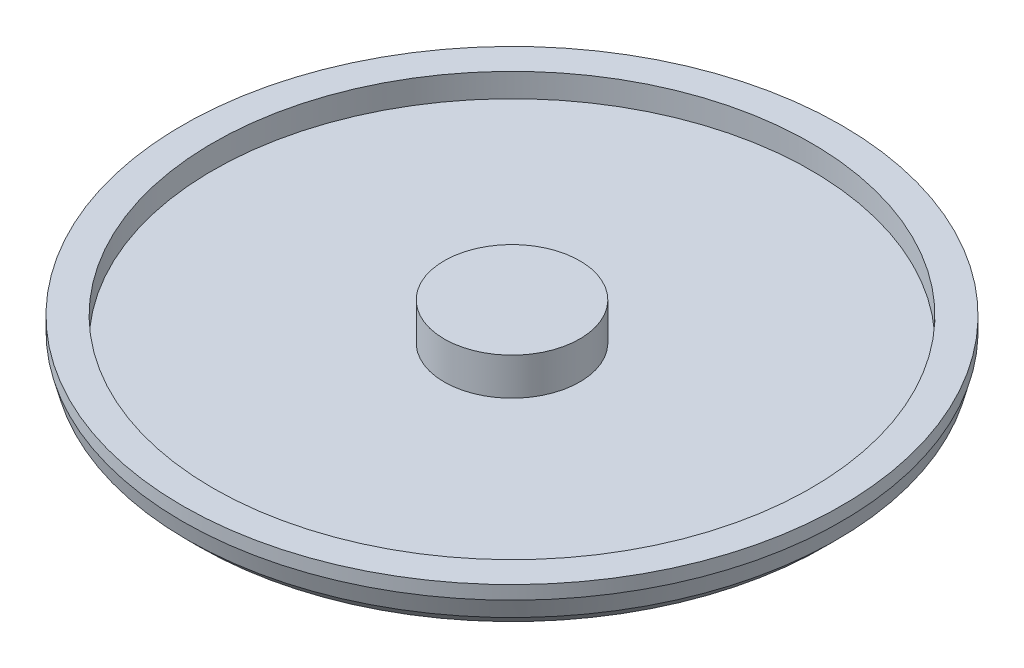
ISO-10303-21;
HEADER;
FILE_DESCRIPTION(('STEP AP214'),'2;1');
FILE_NAME('part.step','',(''),(''),'','','');
FILE_SCHEMA(('AUTOMOTIVE_DESIGN { 1 0 10303 214 1 1 1 1 }'));
ENDSEC;
DATA;
#1=APPLICATION_CONTEXT('core data for automotive mechanical design processes');
#2=APPLICATION_PROTOCOL_DEFINITION('international standard','automotive_design',2000,#1);
#3=PRODUCT_CONTEXT('',#1,'mechanical');
#4=PRODUCT('Part','Part','',(#3));
#5=PRODUCT_RELATED_PRODUCT_CATEGORY('part','',(#4));
#6=PRODUCT_DEFINITION_FORMATION('','',#4);
#7=PRODUCT_DEFINITION_CONTEXT('part definition',#1,'design');
#8=PRODUCT_DEFINITION('design','',#6,#7);
#9=PRODUCT_DEFINITION_SHAPE('','',#8);
#10=(LENGTH_UNIT() NAMED_UNIT(*) SI_UNIT(.MILLI.,.METRE.));
#11=(NAMED_UNIT(*) PLANE_ANGLE_UNIT() SI_UNIT($,.RADIAN.));
#12=(NAMED_UNIT(*) SI_UNIT($,.STERADIAN.) SOLID_ANGLE_UNIT());
#13=UNCERTAINTY_MEASURE_WITH_UNIT(LENGTH_MEASURE(1.E-05),#10,'distance_accuracy_value','');
#14=(GEOMETRIC_REPRESENTATION_CONTEXT(3) GLOBAL_UNCERTAINTY_ASSIGNED_CONTEXT((#13)) GLOBAL_UNIT_ASSIGNED_CONTEXT((#10,
#11,#12)) REPRESENTATION_CONTEXT('',''));
#15=CARTESIAN_POINT('',(0.,0.,0.));
#16=DIRECTION('',(0.,0.,1.));
#17=DIRECTION('',(1.,0.,0.));
#18=AXIS2_PLACEMENT_3D('',#15,#16,#17);
#19=CARTESIAN_POINT('',(0.,65.,0.));
#20=DIRECTION('',(0.,-1.,0.));
#21=DIRECTION('',(0.,0.,-1.));
#22=AXIS2_PLACEMENT_3D('',#19,#20,#21);
#23=CYLINDRICAL_SURFACE('',#22,486.25);
#24=CARTESIAN_POINT('',(0.,65.,0.));
#25=DIRECTION('',(0.,1.,0.));
#26=DIRECTION('',(0.,0.,1.));
#27=AXIS2_PLACEMENT_3D('',#24,#25,#26);
#28=CIRCLE('',#27,486.25);
#29=CARTESIAN_POINT('',(0.,65.,486.25));
#30=VERTEX_POINT('',#29);
#31=EDGE_CURVE('E11',#30,#30,#28,.T.);
#32=ORIENTED_EDGE('',*,*,#31,.F.);
#33=EDGE_LOOP('',(#32));
#34=FACE_BOUND('',#33,.T.);
#35=CARTESIAN_POINT('',(0.,45.,0.));
#36=DIRECTION('',(0.,1.,0.));
#37=DIRECTION('',(0.,0.,1.));
#38=AXIS2_PLACEMENT_3D('',#35,#36,#37);
#39=CIRCLE('',#38,486.25);
#40=CARTESIAN_POINT('',(0.,45.,486.25));
#41=VERTEX_POINT('',#40);
#42=EDGE_CURVE('E62',#41,#41,#39,.T.);
#43=ORIENTED_EDGE('',*,*,#42,.T.);
#44=EDGE_LOOP('',(#43));
#45=FACE_BOUND('',#44,.T.);
#46=ADVANCED_FACE('F40',(#34,#45),#23,.T.);
#47=CARTESIAN_POINT('',(0.,65.,0.));
#48=DIRECTION('',(0.,1.,0.));
#49=DIRECTION('',(0.,0.,1.));
#50=AXIS2_PLACEMENT_3D('',#47,#48,#49);
#51=PLANE('',#50);
#52=CARTESIAN_POINT('',(0.,65.,0.));
#53=DIRECTION('',(0.,1.,0.));
#54=DIRECTION('',(0.,0.,1.));
#55=AXIS2_PLACEMENT_3D('',#52,#53,#54);
#56=CIRCLE('',#55,441.25);
#57=CARTESIAN_POINT('',(0.,65.,441.25));
#58=VERTEX_POINT('',#57);
#59=EDGE_CURVE('E50',#58,#58,#56,.T.);
#60=ORIENTED_EDGE('',*,*,#59,.F.);
#61=EDGE_LOOP('',(#60));
#62=FACE_BOUND('',#61,.T.);
#63=ORIENTED_EDGE('',*,*,#31,.T.);
#64=EDGE_LOOP('',(#63));
#65=FACE_BOUND('',#64,.T.);
#66=ADVANCED_FACE('F94',(#62,#65),#51,.T.);
#67=CARTESIAN_POINT('',(0.,-1248.04346879426,0.));
#68=DIRECTION('',(0.,1.,0.));
#69=DIRECTION('',(0.,0.,1.));
#70=AXIS2_PLACEMENT_3D('',#67,#68,#69);
#71=CYLINDRICAL_SURFACE('',#70,441.25);
#72=CARTESIAN_POINT('',(0.,30.,0.));
#73=DIRECTION('',(0.,1.,0.));
#74=DIRECTION('',(0.,0.,1.));
#75=AXIS2_PLACEMENT_3D('',#72,#73,#74);
#76=CIRCLE('',#75,441.25);
#77=CARTESIAN_POINT('',(0.,30.,441.25));
#78=VERTEX_POINT('',#77);
#79=EDGE_CURVE('E46',#78,#78,#76,.F.);
#80=ORIENTED_EDGE('',*,*,#79,.T.);
#81=EDGE_LOOP('',(#80));
#82=FACE_BOUND('',#81,.T.);
#83=ORIENTED_EDGE('',*,*,#59,.T.);
#84=EDGE_LOOP('',(#83));
#85=FACE_BOUND('',#84,.T.);
#86=ADVANCED_FACE('F85',(#82,#85),#71,.F.);
#87=CARTESIAN_POINT('',(0.,30.,0.));
#88=DIRECTION('',(0.,1.,0.));
#89=DIRECTION('',(0.,0.,1.));
#90=AXIS2_PLACEMENT_3D('',#87,#88,#89);
#91=PLANE('',#90);
#92=CARTESIAN_POINT('',(0.,30.,0.));
#93=DIRECTION('',(0.,1.,0.));
#94=DIRECTION('',(0.,0.,1.));
#95=AXIS2_PLACEMENT_3D('',#92,#93,#94);
#96=CIRCLE('',#95,100.);
#97=CARTESIAN_POINT('',(0.,30.,100.));
#98=VERTEX_POINT('',#97);
#99=EDGE_CURVE('E66',#98,#98,#96,.T.);
#100=ORIENTED_EDGE('',*,*,#99,.F.);
#101=EDGE_LOOP('',(#100));
#102=FACE_BOUND('',#101,.T.);
#103=ORIENTED_EDGE('',*,*,#79,.F.);
#104=EDGE_LOOP('',(#103));
#105=FACE_BOUND('',#104,.T.);
#106=ADVANCED_FACE('F81',(#102,#105),#91,.T.);
#107=CARTESIAN_POINT('',(0.,17.6794919243113,0.));
#108=DIRECTION('',(0.,1.,0.));
#109=DIRECTION('',(0.,0.,1.));
#110=AXIS2_PLACEMENT_3D('',#107,#108,#109);
#111=CONICAL_SURFACE('',#110,478.929491924311,0.785398163397453);
#112=CARTESIAN_POINT('',(0.,0.,0.));
#113=DIRECTION('',(0.,1.,0.));
#114=DIRECTION('',(0.,0.,1.));
#115=AXIS2_PLACEMENT_3D('',#112,#113,#114);
#116=CIRCLE('',#115,461.25);
#117=CARTESIAN_POINT('',(0.,0.,461.25));
#118=VERTEX_POINT('',#117);
#119=EDGE_CURVE('E54',#118,#118,#116,.T.);
#120=ORIENTED_EDGE('',*,*,#119,.T.);
#121=EDGE_LOOP('',(#120));
#122=FACE_BOUND('',#121,.T.);
#123=CARTESIAN_POINT('',(0.,17.6794919243113,0.));
#124=DIRECTION('',(0.,1.,0.));
#125=DIRECTION('',(0.,0.,1.));
#126=AXIS2_PLACEMENT_3D('',#123,#124,#125);
#127=CIRCLE('',#126,478.929491924311);
#128=CARTESIAN_POINT('',(0.,17.6794919243113,478.929491924311));
#129=VERTEX_POINT('',#128);
#130=EDGE_CURVE('E59',#129,#129,#127,.T.);
#131=ORIENTED_EDGE('',*,*,#130,.F.);
#132=EDGE_LOOP('',(#131));
#133=FACE_BOUND('',#132,.T.);
#134=ADVANCED_FACE('F84',(#122,#133),#111,.T.);
#135=CARTESIAN_POINT('',(0.,45.,0.));
#136=DIRECTION('',(0.,1.,0.));
#137=DIRECTION('',(0.,0.,1.));
#138=AXIS2_PLACEMENT_3D('',#135,#136,#137);
#139=CONICAL_SURFACE('',#138,486.25,0.261799387799143);
#140=ORIENTED_EDGE('',*,*,#130,.T.);
#141=EDGE_LOOP('',(#140));
#142=FACE_BOUND('',#141,.T.);
#143=ORIENTED_EDGE('',*,*,#42,.F.);
#144=EDGE_LOOP('',(#143));
#145=FACE_BOUND('',#144,.T.);
#146=ADVANCED_FACE('F91',(#142,#145),#139,.T.);
#147=CARTESIAN_POINT('',(0.,0.,0.));
#148=DIRECTION('',(0.,1.,0.));
#149=DIRECTION('',(0.,0.,1.));
#150=AXIS2_PLACEMENT_3D('',#147,#148,#149);
#151=PLANE('',#150);
#152=ORIENTED_EDGE('',*,*,#119,.F.);
#153=EDGE_LOOP('',(#152));
#154=FACE_BOUND('',#153,.T.);
#155=ADVANCED_FACE('F77',(#154),#151,.F.);
#156=CARTESIAN_POINT('',(0.,85.,0.));
#157=DIRECTION('',(0.,-1.,0.));
#158=DIRECTION('',(0.,0.,-1.));
#159=AXIS2_PLACEMENT_3D('',#156,#157,#158);
#160=CYLINDRICAL_SURFACE('',#159,100.);
#161=CARTESIAN_POINT('',(0.,85.,0.));
#162=DIRECTION('',(0.,1.,0.));
#163=DIRECTION('',(0.,0.,1.));
#164=AXIS2_PLACEMENT_3D('',#161,#162,#163);
#165=CIRCLE('',#164,100.);
#166=CARTESIAN_POINT('',(0.,85.,100.));
#167=VERTEX_POINT('',#166);
#168=EDGE_CURVE('E65',#167,#167,#165,.T.);
#169=ORIENTED_EDGE('',*,*,#168,.F.);
#170=EDGE_LOOP('',(#169));
#171=FACE_BOUND('',#170,.T.);
#172=ORIENTED_EDGE('',*,*,#99,.T.);
#173=EDGE_LOOP('',(#172));
#174=FACE_BOUND('',#173,.T.);
#175=ADVANCED_FACE('F74',(#171,#174),#160,.T.);
#176=CARTESIAN_POINT('',(0.,85.,0.));
#177=DIRECTION('',(0.,1.,0.));
#178=DIRECTION('',(0.,0.,1.));
#179=AXIS2_PLACEMENT_3D('',#176,#177,#178);
#180=PLANE('',#179);
#181=ORIENTED_EDGE('',*,*,#168,.T.);
#182=EDGE_LOOP('',(#181));
#183=FACE_BOUND('',#182,.T.);
#184=ADVANCED_FACE('F72',(#183),#180,.T.);
#185=CLOSED_SHELL('',(#46,#66,#86,#106,#134,#146,#155,#175,#184));
#186=MANIFOLD_SOLID_BREP('B2',#185);
#187=ADVANCED_BREP_SHAPE_REPRESENTATION('',(#18,#186),#14);
#188=SHAPE_DEFINITION_REPRESENTATION(#9,#187);
ENDSEC;
END-ISO-10303-21;
